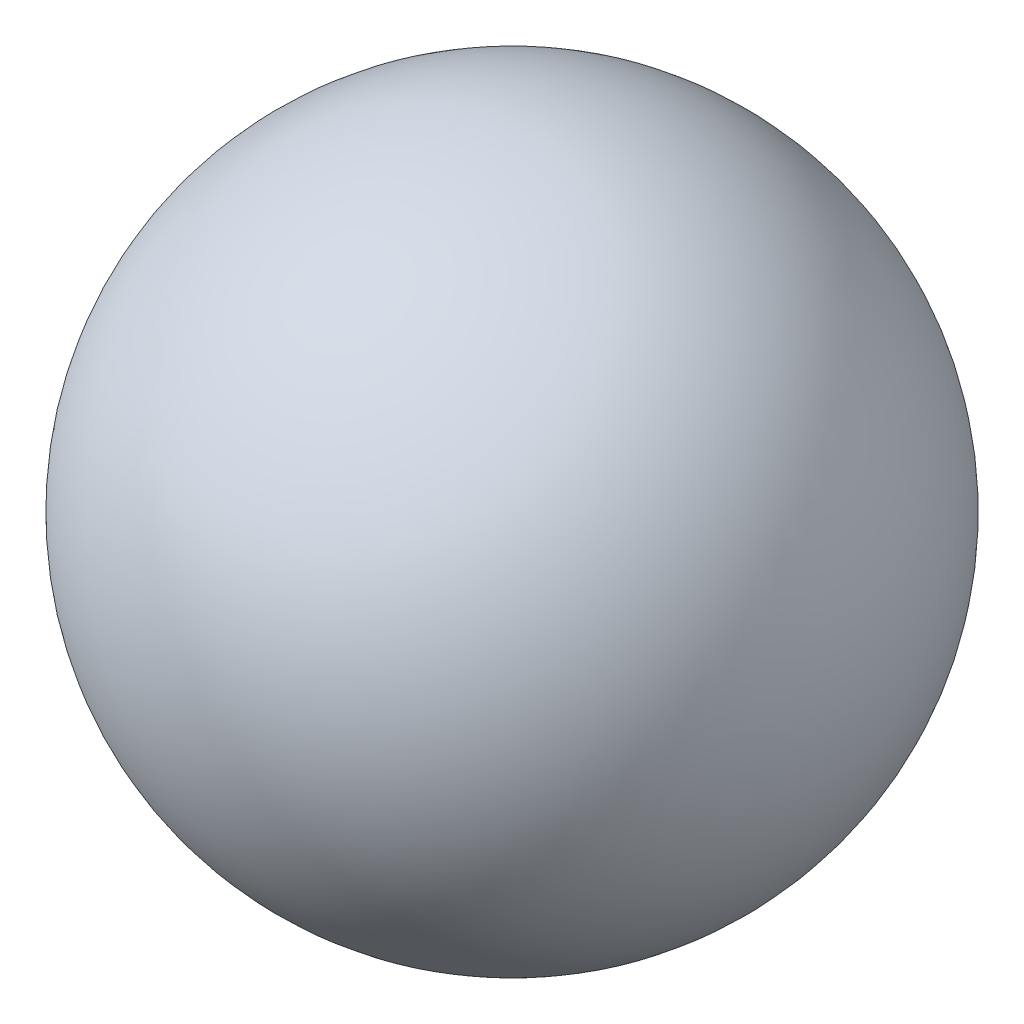
ISO-10303-21;
HEADER;
FILE_DESCRIPTION(('STEP AP214'),'2;1');
FILE_NAME('part.step','',(''),(''),'','','');
FILE_SCHEMA(('AUTOMOTIVE_DESIGN { 1 0 10303 214 1 1 1 1 }'));
ENDSEC;
DATA;
#1=APPLICATION_CONTEXT('core data for automotive mechanical design processes');
#2=APPLICATION_PROTOCOL_DEFINITION('international standard','automotive_design',2000,#1);
#3=PRODUCT_CONTEXT('',#1,'mechanical');
#4=PRODUCT('Part','Part','',(#3));
#5=PRODUCT_RELATED_PRODUCT_CATEGORY('part','',(#4));
#6=PRODUCT_DEFINITION_FORMATION('','',#4);
#7=PRODUCT_DEFINITION_CONTEXT('part definition',#1,'design');
#8=PRODUCT_DEFINITION('design','',#6,#7);
#9=PRODUCT_DEFINITION_SHAPE('','',#8);
#10=(LENGTH_UNIT() NAMED_UNIT(*) SI_UNIT(.MILLI.,.METRE.));
#11=(NAMED_UNIT(*) PLANE_ANGLE_UNIT() SI_UNIT($,.RADIAN.));
#12=(NAMED_UNIT(*) SI_UNIT($,.STERADIAN.) SOLID_ANGLE_UNIT());
#13=UNCERTAINTY_MEASURE_WITH_UNIT(LENGTH_MEASURE(1.E-05),#10,'distance_accuracy_value','');
#14=(GEOMETRIC_REPRESENTATION_CONTEXT(3) GLOBAL_UNCERTAINTY_ASSIGNED_CONTEXT((#13)) GLOBAL_UNIT_ASSIGNED_CONTEXT((#10,
#11,#12)) REPRESENTATION_CONTEXT('',''));
#15=CARTESIAN_POINT('',(0.,0.,0.));
#16=DIRECTION('',(0.,0.,1.));
#17=DIRECTION('',(1.,0.,0.));
#18=AXIS2_PLACEMENT_3D('',#15,#16,#17);
#19=CARTESIAN_POINT('',(0.,0.,0.));
#20=DIRECTION('',(0.,1.,0.));
#21=DIRECTION('',(1.,0.,0.));
#22=AXIS2_PLACEMENT_3D('',#19,#20,#21);
#23=SPHERICAL_SURFACE('',#22,20.);
#24=CARTESIAN_POINT('',(0.,20.,0.));
#25=VERTEX_POINT('',#24);
#26=VERTEX_LOOP('',#25);
#27=FACE_BOUND('',#26,.T.);
#28=ADVANCED_FACE('F31',(#27),#23,.T.);
#29=CLOSED_SHELL('',(#28));
#30=CARTESIAN_POINT('',(0.,0.,0.));
#31=DIRECTION('',(0.,1.,0.));
#32=DIRECTION('',(1.,0.,0.));
#33=AXIS2_PLACEMENT_3D('',#30,#31,#32);
#34=SPHERICAL_SURFACE('',#33,19.);
#35=CARTESIAN_POINT('',(0.,19.,0.));
#36=VERTEX_POINT('',#35);
#37=VERTEX_LOOP('',#36);
#38=FACE_BOUND('',#37,.T.);
#39=ADVANCED_FACE('F33',(#38),#34,.F.);
#40=CLOSED_SHELL('',(#39));
#41=ORIENTED_CLOSED_SHELL('',*,#40,.T.);
#42=BREP_WITH_VOIDS('B2',#29,(#41));
#43=ADVANCED_BREP_SHAPE_REPRESENTATION('',(#18,#42),#14);
#44=SHAPE_DEFINITION_REPRESENTATION(#9,#43);
ENDSEC;
END-ISO-10303-21;
